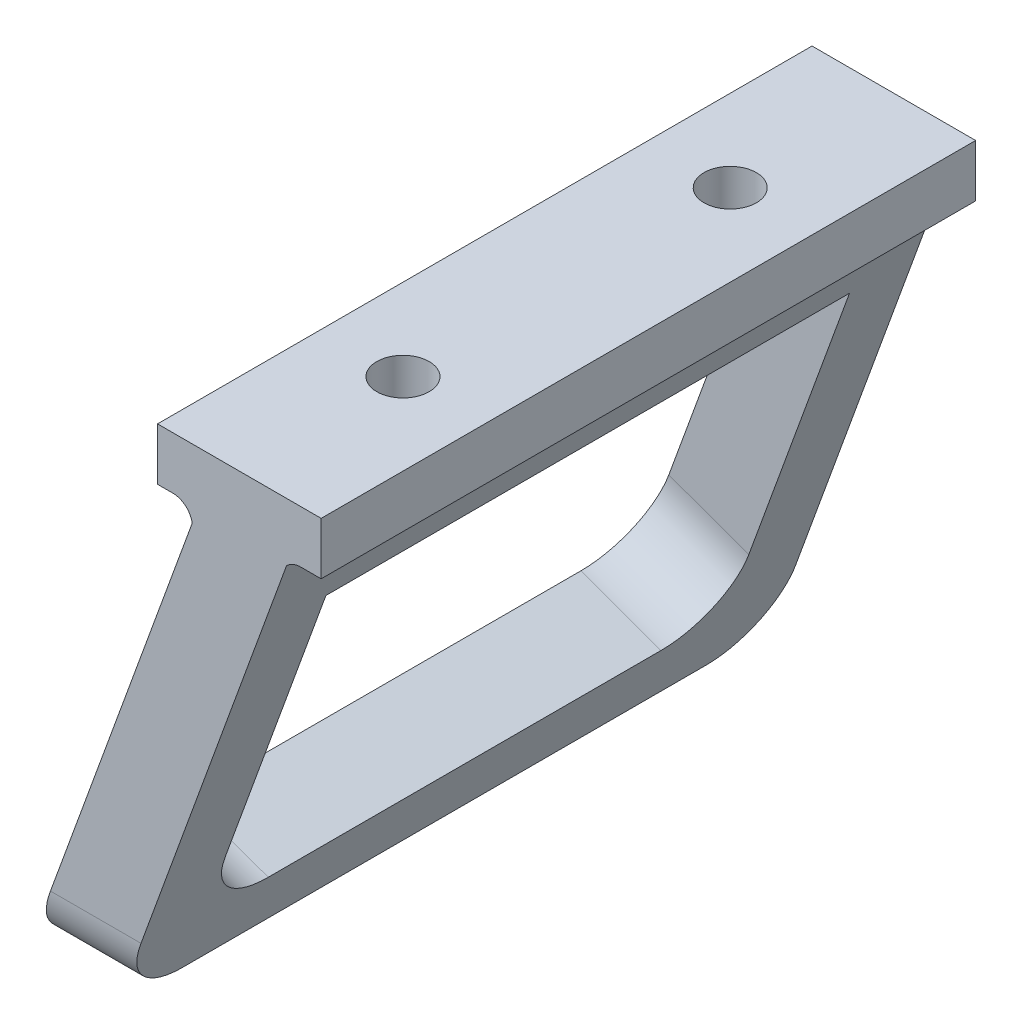
ISO-10303-21;
HEADER;
FILE_DESCRIPTION(('STEP AP214'),'2;1');
FILE_NAME('part.step','',(''),(''),'','','');
FILE_SCHEMA(('AUTOMOTIVE_DESIGN { 1 0 10303 214 1 1 1 1 }'));
ENDSEC;
DATA;
#1=APPLICATION_CONTEXT('core data for automotive mechanical design processes');
#2=APPLICATION_PROTOCOL_DEFINITION('international standard','automotive_design',2000,#1);
#3=PRODUCT_CONTEXT('',#1,'mechanical');
#4=PRODUCT('Part','Part','',(#3));
#5=PRODUCT_RELATED_PRODUCT_CATEGORY('part','',(#4));
#6=PRODUCT_DEFINITION_FORMATION('','',#4);
#7=PRODUCT_DEFINITION_CONTEXT('part definition',#1,'design');
#8=PRODUCT_DEFINITION('design','',#6,#7);
#9=PRODUCT_DEFINITION_SHAPE('','',#8);
#10=(LENGTH_UNIT() NAMED_UNIT(*) SI_UNIT(.MILLI.,.METRE.));
#11=(NAMED_UNIT(*) PLANE_ANGLE_UNIT() SI_UNIT($,.RADIAN.));
#12=(NAMED_UNIT(*) SI_UNIT($,.STERADIAN.) SOLID_ANGLE_UNIT());
#13=UNCERTAINTY_MEASURE_WITH_UNIT(LENGTH_MEASURE(1.E-05),#10,'distance_accuracy_value','');
#14=(GEOMETRIC_REPRESENTATION_CONTEXT(3) GLOBAL_UNCERTAINTY_ASSIGNED_CONTEXT((#13)) GLOBAL_UNIT_ASSIGNED_CONTEXT((#10,
#11,#12)) REPRESENTATION_CONTEXT('',''));
#15=CARTESIAN_POINT('',(0.,0.,0.));
#16=DIRECTION('',(0.,0.,1.));
#17=DIRECTION('',(1.,0.,0.));
#18=AXIS2_PLACEMENT_3D('',#15,#16,#17);
#19=CARTESIAN_POINT('',(-12.5,0.,-50.));
#20=DIRECTION('',(-1.,0.,0.));
#21=DIRECTION('',(0.,0.,1.));
#22=AXIS2_PLACEMENT_3D('',#19,#20,#21);
#23=PLANE('',#22);
#24=DIRECTION('',(0.,0.,1.));
#25=VECTOR('',#24,1.);
#26=CARTESIAN_POINT('',(-12.5,0.,-50.));
#27=LINE('',#26,#25);
#28=CARTESIAN_POINT('',(-12.5,0.,-50.));
#29=VERTEX_POINT('',#28);
#30=CARTESIAN_POINT('',(-12.5,0.,50.));
#31=VERTEX_POINT('',#30);
#32=EDGE_CURVE('E327',#29,#31,#27,.T.);
#33=ORIENTED_EDGE('',*,*,#32,.T.);
#34=DIRECTION('',(0.,-1.,0.));
#35=VECTOR('',#34,1.);
#36=CARTESIAN_POINT('',(-12.5,0.,50.));
#37=LINE('',#36,#35);
#38=CARTESIAN_POINT('',(-12.5,8.,50.));
#39=VERTEX_POINT('',#38);
#40=EDGE_CURVE('E257',#39,#31,#37,.T.);
#41=ORIENTED_EDGE('',*,*,#40,.F.);
#42=DIRECTION('',(0.,0.,1.));
#43=VECTOR('',#42,1.);
#44=CARTESIAN_POINT('',(-12.5,8.,-50.));
#45=LINE('',#44,#43);
#46=CARTESIAN_POINT('',(-12.5,8.,-50.));
#47=VERTEX_POINT('',#46);
#48=EDGE_CURVE('E328',#47,#39,#45,.T.);
#49=ORIENTED_EDGE('',*,*,#48,.F.);
#50=DIRECTION('',(0.,-1.,0.));
#51=VECTOR('',#50,1.);
#52=CARTESIAN_POINT('',(-12.5,0.,-50.));
#53=LINE('',#52,#51);
#54=EDGE_CURVE('E292',#47,#29,#53,.T.);
#55=ORIENTED_EDGE('',*,*,#54,.T.);
#56=EDGE_LOOP('',(#33,#41,#49,#55));
#57=FACE_BOUND('',#56,.T.);
#58=ADVANCED_FACE('F43',(#57),#23,.T.);
#59=CARTESIAN_POINT('',(-12.5,8.,-50.));
#60=DIRECTION('',(0.,1.,0.));
#61=DIRECTION('',(0.,0.,1.));
#62=AXIS2_PLACEMENT_3D('',#59,#60,#61);
#63=PLANE('',#62);
#64=CARTESIAN_POINT('',(0.,8.,-25.));
#65=DIRECTION('',(0.,1.,0.));
#66=DIRECTION('',(0.,0.,1.));
#67=AXIS2_PLACEMENT_3D('',#64,#65,#66);
#68=CIRCLE('',#67,3.99999999999999);
#69=CARTESIAN_POINT('',(0.,8.,-21.));
#70=VERTEX_POINT('',#69);
#71=EDGE_CURVE('E186',#70,#70,#68,.T.);
#72=ORIENTED_EDGE('',*,*,#71,.F.);
#73=EDGE_LOOP('',(#72));
#74=FACE_BOUND('',#73,.T.);
#75=CARTESIAN_POINT('',(0.,8.,25.));
#76=DIRECTION('',(0.,1.,0.));
#77=DIRECTION('',(0.,0.,1.));
#78=AXIS2_PLACEMENT_3D('',#75,#76,#77);
#79=CIRCLE('',#78,3.99999999999999);
#80=CARTESIAN_POINT('',(0.,8.,29.));
#81=VERTEX_POINT('',#80);
#82=EDGE_CURVE('E185',#81,#81,#79,.T.);
#83=ORIENTED_EDGE('',*,*,#82,.F.);
#84=EDGE_LOOP('',(#83));
#85=FACE_BOUND('',#84,.T.);
#86=ORIENTED_EDGE('',*,*,#48,.T.);
#87=DIRECTION('',(-1.,0.,0.));
#88=VECTOR('',#87,1.);
#89=CARTESIAN_POINT('',(-12.5,8.,50.));
#90=LINE('',#89,#88);
#91=CARTESIAN_POINT('',(12.5,8.,50.));
#92=VERTEX_POINT('',#91);
#93=EDGE_CURVE('E288',#92,#39,#90,.T.);
#94=ORIENTED_EDGE('',*,*,#93,.F.);
#95=DIRECTION('',(0.,0.,1.));
#96=VECTOR('',#95,1.);
#97=CARTESIAN_POINT('',(12.5,8.,-50.));
#98=LINE('',#97,#96);
#99=CARTESIAN_POINT('',(12.5,8.,-50.));
#100=VERTEX_POINT('',#99);
#101=EDGE_CURVE('E332',#100,#92,#98,.T.);
#102=ORIENTED_EDGE('',*,*,#101,.F.);
#103=DIRECTION('',(-1.,0.,0.));
#104=VECTOR('',#103,1.);
#105=CARTESIAN_POINT('',(-12.5,8.,-50.));
#106=LINE('',#105,#104);
#107=EDGE_CURVE('E323',#100,#47,#106,.T.);
#108=ORIENTED_EDGE('',*,*,#107,.T.);
#109=EDGE_LOOP('',(#86,#94,#102,#108));
#110=FACE_BOUND('',#109,.T.);
#111=ADVANCED_FACE('F426',(#74,#85,#110),#63,.T.);
#112=CARTESIAN_POINT('',(12.5,8.,-50.));
#113=DIRECTION('',(1.,0.,0.));
#114=DIRECTION('',(0.,1.,0.));
#115=AXIS2_PLACEMENT_3D('',#112,#113,#114);
#116=PLANE('',#115);
#117=ORIENTED_EDGE('',*,*,#101,.T.);
#118=DIRECTION('',(0.,1.,0.));
#119=VECTOR('',#118,1.);
#120=CARTESIAN_POINT('',(12.5,8.,50.));
#121=LINE('',#120,#119);
#122=CARTESIAN_POINT('',(12.5,0.,50.));
#123=VERTEX_POINT('',#122);
#124=EDGE_CURVE('E284',#123,#92,#121,.T.);
#125=ORIENTED_EDGE('',*,*,#124,.F.);
#126=DIRECTION('',(0.,0.,1.));
#127=VECTOR('',#126,1.);
#128=CARTESIAN_POINT('',(12.5,0.,-50.));
#129=LINE('',#128,#127);
#130=CARTESIAN_POINT('',(12.5,0.,-50.));
#131=VERTEX_POINT('',#130);
#132=EDGE_CURVE('E335',#131,#123,#129,.T.);
#133=ORIENTED_EDGE('',*,*,#132,.F.);
#134=DIRECTION('',(0.,1.,0.));
#135=VECTOR('',#134,1.);
#136=CARTESIAN_POINT('',(12.5,8.,-50.));
#137=LINE('',#136,#135);
#138=EDGE_CURVE('E319',#131,#100,#137,.T.);
#139=ORIENTED_EDGE('',*,*,#138,.T.);
#140=EDGE_LOOP('',(#117,#125,#133,#139));
#141=FACE_BOUND('',#140,.T.);
#142=ADVANCED_FACE('F429',(#141),#116,.T.);
#143=CARTESIAN_POINT('',(12.5,0.,-50.));
#144=DIRECTION('',(0.,-1.,0.));
#145=DIRECTION('',(1.,0.,0.));
#146=AXIS2_PLACEMENT_3D('',#143,#144,#145);
#147=PLANE('',#146);
#148=ORIENTED_EDGE('',*,*,#132,.T.);
#149=DIRECTION('',(1.,0.,0.));
#150=VECTOR('',#149,1.);
#151=CARTESIAN_POINT('',(12.5,0.,50.));
#152=LINE('',#151,#150);
#153=CARTESIAN_POINT('',(9.37580741713609,0.,50.));
#154=VERTEX_POINT('',#153);
#155=EDGE_CURVE('E280',#154,#123,#152,.T.);
#156=ORIENTED_EDGE('',*,*,#155,.F.);
#157=DIRECTION('',(0.,0.,1.));
#158=VECTOR('',#157,1.);
#159=CARTESIAN_POINT('',(9.37580741713609,0.,-50.));
#160=LINE('',#159,#158);
#161=CARTESIAN_POINT('',(9.37580741713609,0.,-50.));
#162=VERTEX_POINT('',#161);
#163=EDGE_CURVE('E338',#162,#154,#160,.T.);
#164=ORIENTED_EDGE('',*,*,#163,.F.);
#165=DIRECTION('',(1.,0.,0.));
#166=VECTOR('',#165,1.);
#167=CARTESIAN_POINT('',(12.5,0.,-50.));
#168=LINE('',#167,#166);
#169=EDGE_CURVE('E315',#162,#131,#168,.T.);
#170=ORIENTED_EDGE('',*,*,#169,.T.);
#171=EDGE_LOOP('',(#148,#156,#164,#170));
#172=FACE_BOUND('',#171,.T.);
#173=ADVANCED_FACE('F431',(#172),#147,.T.);
#174=CARTESIAN_POINT('',(9.37580741713609,-3.,-50.));
#175=DIRECTION('',(0.,0.,1.));
#176=DIRECTION('',(1.,0.,0.));
#177=AXIS2_PLACEMENT_3D('',#174,#175,#176);
#178=CYLINDRICAL_SURFACE('',#177,2.99999999999998);
#179=ORIENTED_EDGE('',*,*,#163,.T.);
#180=CARTESIAN_POINT('',(9.37580741713609,-3.,50.));
#181=DIRECTION('',(0.,0.,-1.));
#182=DIRECTION('',(1.,0.,0.));
#183=AXIS2_PLACEMENT_3D('',#180,#181,#182);
#184=CIRCLE('',#183,2.99999999999998);
#185=CARTESIAN_POINT('',(7.20000000000002,-0.934603649771899,50.));
#186=VERTEX_POINT('',#185);
#187=EDGE_CURVE('E276',#186,#154,#184,.T.);
#188=ORIENTED_EDGE('',*,*,#187,.F.);
#189=DIRECTION('',(0.,0.,1.));
#190=VECTOR('',#189,1.);
#191=CARTESIAN_POINT('',(7.20000000000002,-0.934603649771899,-50.));
#192=LINE('',#191,#190);
#193=CARTESIAN_POINT('',(7.20000000000002,-0.934603649771899,-50.));
#194=VERTEX_POINT('',#193);
#195=EDGE_CURVE('E341',#194,#186,#192,.T.);
#196=ORIENTED_EDGE('',*,*,#195,.F.);
#197=CARTESIAN_POINT('',(9.37580741713609,-3.,-50.));
#198=DIRECTION('',(0.,0.,-1.));
#199=DIRECTION('',(1.,0.,0.));
#200=AXIS2_PLACEMENT_3D('',#197,#198,#199);
#201=CIRCLE('',#200,2.99999999999998);
#202=EDGE_CURVE('E311',#194,#162,#201,.T.);
#203=ORIENTED_EDGE('',*,*,#202,.T.);
#204=EDGE_LOOP('',(#179,#188,#196,#203));
#205=FACE_BOUND('',#204,.T.);
#206=ADVANCED_FACE('F403',(#205),#178,.F.);
#207=CARTESIAN_POINT('',(7.20000000000003,-0.934603649771912,-50.));
#208=DIRECTION('',(0.939692620785908,-0.34202014332567,0.));
#209=DIRECTION('',(0.34202014332567,0.939692620785908,0.));
#210=AXIS2_PLACEMENT_3D('',#207,#208,#209);
#211=PLANE('',#210);
#212=DIRECTION('',(0.34202014332567,0.939692620785908,0.));
#213=VECTOR('',#212,1.);
#214=CARTESIAN_POINT('',(7.20000000000003,-0.934603649771911,-40.));
#215=LINE('',#214,#213);
#216=CARTESIAN_POINT('',(-12.1631879404359,-54.1345252847756,-40.));
#217=VERTEX_POINT('',#216);
#218=CARTESIAN_POINT('',(3.22771850921919,-11.8483573494098,-40.));
#219=VERTEX_POINT('',#218);
#220=EDGE_CURVE('E254',#217,#219,#215,.T.);
#221=ORIENTED_EDGE('',*,*,#220,.F.);
#222=CARTESIAN_POINT('',(-12.163187940436,-54.1345252847757,-30.));
#223=DIRECTION('',(0.939692620785908,-0.34202014332567,0.));
#224=DIRECTION('',(0.34202014332567,0.939692620785908,0.));
#225=AXIS2_PLACEMENT_3D('',#222,#223,#224);
#226=CIRCLE('',#225,10.);
#227=CARTESIAN_POINT('',(-15.5833893736927,-63.5314514926347,-29.9999999999999));
#228=VERTEX_POINT('',#227);
#229=EDGE_CURVE('E224',#228,#217,#226,.T.);
#230=ORIENTED_EDGE('',*,*,#229,.F.);
#231=DIRECTION('',(0.,0.,-1.));
#232=VECTOR('',#231,1.);
#233=CARTESIAN_POINT('',(-15.5833893736927,-63.5314514926347,-50.));
#234=LINE('',#233,#232);
#235=CARTESIAN_POINT('',(-15.5833893736927,-63.5314514926347,29.9999999999999));
#236=VERTEX_POINT('',#235);
#237=EDGE_CURVE('E240',#236,#228,#234,.T.);
#238=ORIENTED_EDGE('',*,*,#237,.F.);
#239=CARTESIAN_POINT('',(-12.163187940436,-54.1345252847757,30.));
#240=DIRECTION('',(0.939692620785908,-0.34202014332567,0.));
#241=DIRECTION('',(0.34202014332567,0.939692620785908,0.));
#242=AXIS2_PLACEMENT_3D('',#239,#240,#241);
#243=CIRCLE('',#242,10.);
#244=CARTESIAN_POINT('',(-12.1631879404359,-54.1345252847756,40.));
#245=VERTEX_POINT('',#244);
#246=EDGE_CURVE('E243',#245,#236,#243,.T.);
#247=ORIENTED_EDGE('',*,*,#246,.F.);
#248=DIRECTION('',(0.34202014332567,0.939692620785908,0.));
#249=VECTOR('',#248,1.);
#250=CARTESIAN_POINT('',(7.20000000000003,-0.934603649771925,40.));
#251=LINE('',#250,#249);
#252=CARTESIAN_POINT('',(3.22771850921919,-11.8483573494098,40.));
#253=VERTEX_POINT('',#252);
#254=EDGE_CURVE('E246',#245,#253,#251,.T.);
#255=ORIENTED_EDGE('',*,*,#254,.T.);
#256=DIRECTION('',(0.,0.,-1.));
#257=VECTOR('',#256,1.);
#258=CARTESIAN_POINT('',(3.22771850921919,-11.8483573494098,-50.));
#259=LINE('',#258,#257);
#260=EDGE_CURVE('E250',#253,#219,#259,.T.);
#261=ORIENTED_EDGE('',*,*,#260,.T.);
#262=EDGE_LOOP('',(#221,#230,#238,#247,#255,#261));
#263=FACE_BOUND('',#262,.T.);
#264=DIRECTION('',(0.,0.,1.));
#265=VECTOR('',#264,1.);
#266=CARTESIAN_POINT('',(-18.6656889578131,-72.,-50.));
#267=LINE('',#266,#265);
#268=CARTESIAN_POINT('',(-18.6656889578131,-72.,-40.));
#269=VERTEX_POINT('',#268);
#270=CARTESIAN_POINT('',(-18.6656889578131,-72.,40.));
#271=VERTEX_POINT('',#270);
#272=EDGE_CURVE('E345',#269,#271,#267,.T.);
#273=ORIENTED_EDGE('',*,*,#272,.F.);
#274=CARTESIAN_POINT('',(-15.0259866151511,-62.,-40.));
#275=DIRECTION('',(0.939692620785908,-0.34202014332567,0.));
#276=DIRECTION('',(-0.34202014332567,-0.939692620785908,0.));
#277=AXIS2_PLACEMENT_3D('',#274,#275,#276);
#278=ELLIPSE('',#277,10.6417777247591,10.);
#279=CARTESIAN_POINT('',(-15.0259866151511,-62.,-50.));
#280=VERTEX_POINT('',#279);
#281=EDGE_CURVE('E370',#269,#280,#278,.T.);
#282=ORIENTED_EDGE('',*,*,#281,.T.);
#283=DIRECTION('',(0.34202014332567,0.939692620785908,0.));
#284=VECTOR('',#283,1.);
#285=CARTESIAN_POINT('',(7.20000000000003,-0.934603649771912,-50.));
#286=LINE('',#285,#284);
#287=EDGE_CURVE('E308',#280,#194,#286,.T.);
#288=ORIENTED_EDGE('',*,*,#287,.T.);
#289=ORIENTED_EDGE('',*,*,#195,.T.);
#290=DIRECTION('',(0.34202014332567,0.939692620785908,0.));
#291=VECTOR('',#290,1.);
#292=CARTESIAN_POINT('',(7.20000000000003,-0.934603649771912,50.));
#293=LINE('',#292,#291);
#294=CARTESIAN_POINT('',(-15.0259866151511,-62.,50.));
#295=VERTEX_POINT('',#294);
#296=EDGE_CURVE('E273',#295,#186,#293,.T.);
#297=ORIENTED_EDGE('',*,*,#296,.F.);
#298=CARTESIAN_POINT('',(-15.0259866151511,-62.,40.));
#299=DIRECTION('',(0.939692620785908,-0.34202014332567,0.));
#300=DIRECTION('',(0.34202014332567,0.939692620785908,0.));
#301=AXIS2_PLACEMENT_3D('',#298,#299,#300);
#302=ELLIPSE('',#301,10.6417777247591,10.);
#303=EDGE_CURVE('E367',#295,#271,#302,.T.);
#304=ORIENTED_EDGE('',*,*,#303,.T.);
#305=EDGE_LOOP('',(#273,#282,#288,#289,#297,#304));
#306=FACE_BOUND('',#305,.T.);
#307=ADVANCED_FACE('F395',(#263,#306),#211,.T.);
#308=CARTESIAN_POINT('',(-18.6656889578131,-72.,-50.));
#309=DIRECTION('',(0.,-1.,0.));
#310=DIRECTION('',(1.,0.,0.));
#311=AXIS2_PLACEMENT_3D('',#308,#309,#310);
#312=PLANE('',#311);
#313=DIRECTION('',(0.,0.,1.));
#314=VECTOR('',#313,1.);
#315=CARTESIAN_POINT('',(-32.5,-72.,-50.));
#316=LINE('',#315,#314);
#317=CARTESIAN_POINT('',(-32.5,-72.,-40.));
#318=VERTEX_POINT('',#317);
#319=CARTESIAN_POINT('',(-32.5,-72.,40.));
#320=VERTEX_POINT('',#319);
#321=EDGE_CURVE('E349',#318,#320,#316,.T.);
#322=ORIENTED_EDGE('',*,*,#321,.F.);
#323=DIRECTION('',(1.,0.,0.));
#324=VECTOR('',#323,1.);
#325=CARTESIAN_POINT('',(-18.6656889578131,-72.,-40.));
#326=LINE('',#325,#324);
#327=EDGE_CURVE('E363',#318,#269,#326,.T.);
#328=ORIENTED_EDGE('',*,*,#327,.T.);
#329=ORIENTED_EDGE('',*,*,#272,.T.);
#330=DIRECTION('',(1.,0.,0.));
#331=VECTOR('',#330,1.);
#332=CARTESIAN_POINT('',(-18.6656889578131,-72.,40.));
#333=LINE('',#332,#331);
#334=EDGE_CURVE('E331',#271,#320,#333,.F.);
#335=ORIENTED_EDGE('',*,*,#334,.T.);
#336=EDGE_LOOP('',(#322,#328,#329,#335));
#337=FACE_BOUND('',#336,.T.);
#338=ADVANCED_FACE('F389',(#337),#312,.T.);
#339=CARTESIAN_POINT('',(-32.5,-72.,-50.));
#340=DIRECTION('',(-0.939692620785908,0.34202014332567,0.));
#341=DIRECTION('',(-0.34202014332567,-0.939692620785908,0.));
#342=AXIS2_PLACEMENT_3D('',#339,#340,#341);
#343=PLANE('',#342);
#344=DIRECTION('',(-0.34202014332567,-0.939692620785908,0.));
#345=VECTOR('',#344,1.);
#346=CARTESIAN_POINT('',(-8.98828556099762,-7.40209548617608,-40.));
#347=LINE('',#346,#345);
#348=CARTESIAN_POINT('',(-8.98828556099762,-7.40209548617608,-40.));
#349=VERTEX_POINT('',#348);
#350=CARTESIAN_POINT('',(-24.3791920106527,-49.6882634215419,-40.));
#351=VERTEX_POINT('',#350);
#352=EDGE_CURVE('E67',#349,#351,#347,.T.);
#353=ORIENTED_EDGE('',*,*,#352,.F.);
#354=DIRECTION('',(0.,0.,1.));
#355=VECTOR('',#354,1.);
#356=CARTESIAN_POINT('',(-8.98828556099762,-7.40209548617608,-40.));
#357=LINE('',#356,#355);
#358=CARTESIAN_POINT('',(-8.98828556099762,-7.40209548617608,40.));
#359=VERTEX_POINT('',#358);
#360=EDGE_CURVE('E216',#349,#359,#357,.T.);
#361=ORIENTED_EDGE('',*,*,#360,.T.);
#362=DIRECTION('',(-0.34202014332567,-0.939692620785908,0.));
#363=VECTOR('',#362,1.);
#364=CARTESIAN_POINT('',(-8.98828556099762,-7.40209548617608,40.));
#365=LINE('',#364,#363);
#366=CARTESIAN_POINT('',(-24.3791920106527,-49.6882634215419,40.));
#367=VERTEX_POINT('',#366);
#368=EDGE_CURVE('E212',#359,#367,#365,.T.);
#369=ORIENTED_EDGE('',*,*,#368,.T.);
#370=CARTESIAN_POINT('',(-24.3791920106528,-49.6882634215419,30.));
#371=DIRECTION('',(-0.939692620785908,0.34202014332567,0.));
#372=DIRECTION('',(-0.34202014332567,-0.939692620785908,0.));
#373=AXIS2_PLACEMENT_3D('',#370,#371,#372);
#374=CIRCLE('',#373,10.);
#375=CARTESIAN_POINT('',(-27.7993934439095,-59.085189629401,29.9999999999999));
#376=VERTEX_POINT('',#375);
#377=EDGE_CURVE('E208',#376,#367,#374,.T.);
#378=ORIENTED_EDGE('',*,*,#377,.F.);
#379=DIRECTION('',(0.,0.,1.));
#380=VECTOR('',#379,1.);
#381=CARTESIAN_POINT('',(-27.7993934439095,-59.085189629401,-29.9999999999999));
#382=LINE('',#381,#380);
#383=CARTESIAN_POINT('',(-27.7993934439095,-59.085189629401,-29.9999999999999));
#384=VERTEX_POINT('',#383);
#385=EDGE_CURVE('E204',#384,#376,#382,.T.);
#386=ORIENTED_EDGE('',*,*,#385,.F.);
#387=CARTESIAN_POINT('',(-24.3791920106528,-49.6882634215419,-30.));
#388=DIRECTION('',(-0.939692620785908,0.34202014332567,0.));
#389=DIRECTION('',(-0.34202014332567,-0.939692620785908,0.));
#390=AXIS2_PLACEMENT_3D('',#387,#388,#389);
#391=CIRCLE('',#390,10.);
#392=EDGE_CURVE('E201',#351,#384,#391,.T.);
#393=ORIENTED_EDGE('',*,*,#392,.F.);
#394=EDGE_LOOP('',(#353,#361,#369,#378,#386,#393));
#395=FACE_BOUND('',#394,.T.);
#396=DIRECTION('',(-0.34202014332567,-0.939692620785908,0.));
#397=VECTOR('',#396,1.);
#398=CARTESIAN_POINT('',(-32.5,-72.,-50.));
#399=LINE('',#398,#397);
#400=CARTESIAN_POINT('',(-7.19999999999997,-2.48882128779831,-50.));
#401=VERTEX_POINT('',#400);
#402=CARTESIAN_POINT('',(-28.8602976573379,-62.,-50.));
#403=VERTEX_POINT('',#402);
#404=EDGE_CURVE('E304',#401,#403,#399,.T.);
#405=ORIENTED_EDGE('',*,*,#404,.T.);
#406=CARTESIAN_POINT('',(-28.8602976573379,-62.,-40.));
#407=DIRECTION('',(-0.939692620785908,0.34202014332567,0.));
#408=DIRECTION('',(-0.34202014332567,-0.939692620785908,0.));
#409=AXIS2_PLACEMENT_3D('',#406,#407,#408);
#410=ELLIPSE('',#409,10.6417777247591,10.);
#411=EDGE_CURVE('E52',#403,#318,#410,.T.);
#412=ORIENTED_EDGE('',*,*,#411,.T.);
#413=ORIENTED_EDGE('',*,*,#321,.T.);
#414=CARTESIAN_POINT('',(-28.8602976573379,-62.,40.));
#415=DIRECTION('',(-0.939692620785908,0.34202014332567,0.));
#416=DIRECTION('',(0.34202014332567,0.939692620785908,0.));
#417=AXIS2_PLACEMENT_3D('',#414,#415,#416);
#418=ELLIPSE('',#417,10.6417777247591,10.);
#419=CARTESIAN_POINT('',(-28.8602976573379,-62.,50.));
#420=VERTEX_POINT('',#419);
#421=EDGE_CURVE('E376',#320,#420,#418,.T.);
#422=ORIENTED_EDGE('',*,*,#421,.T.);
#423=DIRECTION('',(-0.34202014332567,-0.939692620785908,0.));
#424=VECTOR('',#423,1.);
#425=CARTESIAN_POINT('',(-32.5,-72.,50.));
#426=LINE('',#425,#424);
#427=CARTESIAN_POINT('',(-7.19999999999997,-2.48882128779831,50.));
#428=VERTEX_POINT('',#427);
#429=EDGE_CURVE('E269',#428,#420,#426,.T.);
#430=ORIENTED_EDGE('',*,*,#429,.F.);
#431=DIRECTION('',(0.,0.,1.));
#432=VECTOR('',#431,1.);
#433=CARTESIAN_POINT('',(-7.19999999999997,-2.48882128779831,-50.));
#434=LINE('',#433,#432);
#435=EDGE_CURVE('E353',#401,#428,#434,.T.);
#436=ORIENTED_EDGE('',*,*,#435,.F.);
#437=EDGE_LOOP('',(#405,#412,#413,#422,#430,#436));
#438=FACE_BOUND('',#437,.T.);
#439=ADVANCED_FACE('F382',(#395,#438),#343,.T.);
#440=CARTESIAN_POINT('',(-10.1561286041361,-3.,-50.));
#441=DIRECTION('',(0.,0.,1.));
#442=DIRECTION('',(1.,0.,0.));
#443=AXIS2_PLACEMENT_3D('',#440,#441,#442);
#444=CYLINDRICAL_SURFACE('',#443,3.);
#445=ORIENTED_EDGE('',*,*,#435,.T.);
#446=CARTESIAN_POINT('',(-10.1561286041361,-3.,50.));
#447=DIRECTION('',(0.,0.,-1.));
#448=DIRECTION('',(1.,0.,0.));
#449=AXIS2_PLACEMENT_3D('',#446,#447,#448);
#450=CIRCLE('',#449,3.);
#451=CARTESIAN_POINT('',(-10.1561286041361,0.,50.));
#452=VERTEX_POINT('',#451);
#453=EDGE_CURVE('E265',#452,#428,#450,.T.);
#454=ORIENTED_EDGE('',*,*,#453,.F.);
#455=DIRECTION('',(0.,0.,1.));
#456=VECTOR('',#455,1.);
#457=CARTESIAN_POINT('',(-10.1561286041361,0.,-50.));
#458=LINE('',#457,#456);
#459=CARTESIAN_POINT('',(-10.1561286041361,0.,-50.));
#460=VERTEX_POINT('',#459);
#461=EDGE_CURVE('E356',#460,#452,#458,.T.);
#462=ORIENTED_EDGE('',*,*,#461,.F.);
#463=CARTESIAN_POINT('',(-10.1561286041361,-3.,-50.));
#464=DIRECTION('',(0.,0.,-1.));
#465=DIRECTION('',(1.,0.,0.));
#466=AXIS2_PLACEMENT_3D('',#463,#464,#465);
#467=CIRCLE('',#466,3.);
#468=EDGE_CURVE('E300',#460,#401,#467,.T.);
#469=ORIENTED_EDGE('',*,*,#468,.T.);
#470=EDGE_LOOP('',(#445,#454,#462,#469));
#471=FACE_BOUND('',#470,.T.);
#472=ADVANCED_FACE('F416',(#471),#444,.F.);
#473=CARTESIAN_POINT('',(-10.1561286041361,0.,-50.));
#474=DIRECTION('',(0.,-1.,0.));
#475=DIRECTION('',(0.,0.,-1.));
#476=AXIS2_PLACEMENT_3D('',#473,#474,#475);
#477=PLANE('',#476);
#478=ORIENTED_EDGE('',*,*,#461,.T.);
#479=DIRECTION('',(1.,0.,0.));
#480=VECTOR('',#479,1.);
#481=CARTESIAN_POINT('',(-10.1561286041361,0.,50.));
#482=LINE('',#481,#480);
#483=EDGE_CURVE('E261',#31,#452,#482,.T.);
#484=ORIENTED_EDGE('',*,*,#483,.F.);
#485=ORIENTED_EDGE('',*,*,#32,.F.);
#486=DIRECTION('',(1.,0.,0.));
#487=VECTOR('',#486,1.);
#488=CARTESIAN_POINT('',(-10.1561286041361,0.,-50.));
#489=LINE('',#488,#487);
#490=EDGE_CURVE('E296',#29,#460,#489,.T.);
#491=ORIENTED_EDGE('',*,*,#490,.T.);
#492=EDGE_LOOP('',(#478,#484,#485,#491));
#493=FACE_BOUND('',#492,.T.);
#494=ADVANCED_FACE('F419',(#493),#477,.T.);
#495=CARTESIAN_POINT('',(9.37580741713609,-3.,-50.));
#496=DIRECTION('',(0.,0.,1.));
#497=DIRECTION('',(1.,0.,0.));
#498=AXIS2_PLACEMENT_3D('',#495,#496,#497);
#499=PLANE('',#498);
#500=ORIENTED_EDGE('',*,*,#287,.F.);
#501=DIRECTION('',(1.,0.,0.));
#502=VECTOR('',#501,1.);
#503=CARTESIAN_POINT('',(-32.4999999999999,-62.,-50.));
#504=LINE('',#503,#502);
#505=EDGE_CURVE('E373',#280,#403,#504,.F.);
#506=ORIENTED_EDGE('',*,*,#505,.T.);
#507=ORIENTED_EDGE('',*,*,#404,.F.);
#508=ORIENTED_EDGE('',*,*,#468,.F.);
#509=ORIENTED_EDGE('',*,*,#490,.F.);
#510=ORIENTED_EDGE('',*,*,#54,.F.);
#511=ORIENTED_EDGE('',*,*,#107,.F.);
#512=ORIENTED_EDGE('',*,*,#138,.F.);
#513=ORIENTED_EDGE('',*,*,#169,.F.);
#514=ORIENTED_EDGE('',*,*,#202,.F.);
#515=EDGE_LOOP('',(#500,#506,#507,#508,#509,#510,#511,#512,#513,#514));
#516=FACE_BOUND('',#515,.T.);
#517=ADVANCED_FACE('F399',(#516),#499,.F.);
#518=CARTESIAN_POINT('',(9.37580741713609,-3.,50.));
#519=DIRECTION('',(0.,0.,1.));
#520=DIRECTION('',(1.,0.,0.));
#521=AXIS2_PLACEMENT_3D('',#518,#519,#520);
#522=PLANE('',#521);
#523=ORIENTED_EDGE('',*,*,#429,.T.);
#524=DIRECTION('',(1.,0.,0.));
#525=VECTOR('',#524,1.);
#526=CARTESIAN_POINT('',(9.37580741713603,-62.,50.));
#527=LINE('',#526,#525);
#528=EDGE_CURVE('E11',#420,#295,#527,.T.);
#529=ORIENTED_EDGE('',*,*,#528,.T.);
#530=ORIENTED_EDGE('',*,*,#296,.T.);
#531=ORIENTED_EDGE('',*,*,#187,.T.);
#532=ORIENTED_EDGE('',*,*,#155,.T.);
#533=ORIENTED_EDGE('',*,*,#124,.T.);
#534=ORIENTED_EDGE('',*,*,#93,.T.);
#535=ORIENTED_EDGE('',*,*,#40,.T.);
#536=ORIENTED_EDGE('',*,*,#483,.T.);
#537=ORIENTED_EDGE('',*,*,#453,.T.);
#538=EDGE_LOOP('',(#523,#529,#530,#531,#532,#533,#534,#535,#536,#537));
#539=FACE_BOUND('',#538,.T.);
#540=ADVANCED_FACE('F407',(#539),#522,.T.);
#541=CARTESIAN_POINT('',(-18.6656889578131,-62.,-40.));
#542=DIRECTION('',(-1.,0.,0.));
#543=DIRECTION('',(0.,-1.,0.));
#544=AXIS2_PLACEMENT_3D('',#541,#542,#543);
#545=CYLINDRICAL_SURFACE('',#544,10.);
#546=ORIENTED_EDGE('',*,*,#411,.F.);
#547=ORIENTED_EDGE('',*,*,#505,.F.);
#548=ORIENTED_EDGE('',*,*,#281,.F.);
#549=ORIENTED_EDGE('',*,*,#327,.F.);
#550=EDGE_LOOP('',(#546,#547,#548,#549));
#551=FACE_BOUND('',#550,.T.);
#552=ADVANCED_FACE('F392',(#551),#545,.T.);
#553=CARTESIAN_POINT('',(9.37580741713603,-62.,40.));
#554=DIRECTION('',(1.,0.,0.));
#555=DIRECTION('',(0.,1.,0.));
#556=AXIS2_PLACEMENT_3D('',#553,#554,#555);
#557=CYLINDRICAL_SURFACE('',#556,10.);
#558=ORIENTED_EDGE('',*,*,#421,.F.);
#559=ORIENTED_EDGE('',*,*,#334,.F.);
#560=ORIENTED_EDGE('',*,*,#303,.F.);
#561=ORIENTED_EDGE('',*,*,#528,.F.);
#562=EDGE_LOOP('',(#558,#559,#560,#561));
#563=FACE_BOUND('',#562,.T.);
#564=ADVANCED_FACE('F45',(#563),#557,.T.);
#565=CARTESIAN_POINT('',(37.9963454782978,-24.5031026524596,-40.));
#566=DIRECTION('',(0.,0.,-1.));
#567=DIRECTION('',(0.,1.,0.));
#568=AXIS2_PLACEMENT_3D('',#565,#566,#567);
#569=PLANE('',#568);
#570=ORIENTED_EDGE('',*,*,#220,.T.);
#571=DIRECTION('',(-0.939692620785908,0.34202014332567,0.));
#572=VECTOR('',#571,1.);
#573=CARTESIAN_POINT('',(37.9963454782978,-24.5031026524596,-40.));
#574=LINE('',#573,#572);
#575=EDGE_CURVE('E221',#219,#349,#574,.T.);
#576=ORIENTED_EDGE('',*,*,#575,.T.);
#577=ORIENTED_EDGE('',*,*,#352,.T.);
#578=DIRECTION('',(-0.939692620785908,0.34202014332567,0.));
#579=VECTOR('',#578,1.);
#580=CARTESIAN_POINT('',(22.6054390286427,-66.7892705878254,-40.));
#581=LINE('',#580,#579);
#582=EDGE_CURVE('E220',#217,#351,#581,.T.);
#583=ORIENTED_EDGE('',*,*,#582,.F.);
#584=EDGE_LOOP('',(#570,#576,#577,#583));
#585=FACE_BOUND('',#584,.T.);
#586=ADVANCED_FACE('F454',(#585),#569,.F.);
#587=CARTESIAN_POINT('',(37.9963454782978,-24.5031026524596,-40.));
#588=DIRECTION('',(-0.34202014332567,-0.939692620785908,0.));
#589=DIRECTION('',(0.939692620785908,-0.34202014332567,0.));
#590=AXIS2_PLACEMENT_3D('',#587,#588,#589);
#591=PLANE('',#590);
#592=DIRECTION('',(-0.939692620785908,0.34202014332567,0.));
#593=VECTOR('',#592,1.);
#594=CARTESIAN_POINT('',(37.9963454782978,-24.5031026524596,40.));
#595=LINE('',#594,#593);
#596=EDGE_CURVE('E225',#253,#359,#595,.T.);
#597=ORIENTED_EDGE('',*,*,#596,.T.);
#598=ORIENTED_EDGE('',*,*,#360,.F.);
#599=ORIENTED_EDGE('',*,*,#575,.F.);
#600=ORIENTED_EDGE('',*,*,#260,.F.);
#601=EDGE_LOOP('',(#597,#598,#599,#600));
#602=FACE_BOUND('',#601,.T.);
#603=ADVANCED_FACE('F463',(#602),#591,.T.);
#604=CARTESIAN_POINT('',(37.9963454782978,-24.5031026524596,40.));
#605=DIRECTION('',(0.,0.,-1.));
#606=DIRECTION('',(0.,1.,0.));
#607=AXIS2_PLACEMENT_3D('',#604,#605,#606);
#608=PLANE('',#607);
#609=DIRECTION('',(-0.939692620785908,0.34202014332567,0.));
#610=VECTOR('',#609,1.);
#611=CARTESIAN_POINT('',(22.6054390286427,-66.7892705878254,40.));
#612=LINE('',#611,#610);
#613=EDGE_CURVE('E228',#245,#367,#612,.T.);
#614=ORIENTED_EDGE('',*,*,#613,.T.);
#615=ORIENTED_EDGE('',*,*,#368,.F.);
#616=ORIENTED_EDGE('',*,*,#596,.F.);
#617=ORIENTED_EDGE('',*,*,#254,.F.);
#618=EDGE_LOOP('',(#614,#615,#616,#617));
#619=FACE_BOUND('',#618,.T.);
#620=ADVANCED_FACE('F475',(#619),#608,.T.);
#621=CARTESIAN_POINT('',(22.6054390286426,-66.7892705878254,30.));
#622=DIRECTION('',(-0.939692620785908,0.34202014332567,0.));
#623=DIRECTION('',(-0.34202014332567,-0.939692620785908,0.));
#624=AXIS2_PLACEMENT_3D('',#621,#622,#623);
#625=CYLINDRICAL_SURFACE('',#624,10.);
#626=ORIENTED_EDGE('',*,*,#246,.T.);
#627=DIRECTION('',(-0.939692620785908,0.34202014332567,0.));
#628=VECTOR('',#627,1.);
#629=CARTESIAN_POINT('',(19.1852375953859,-76.1861967956845,29.9999999999999));
#630=LINE('',#629,#628);
#631=EDGE_CURVE('E231',#236,#376,#630,.T.);
#632=ORIENTED_EDGE('',*,*,#631,.T.);
#633=ORIENTED_EDGE('',*,*,#377,.T.);
#634=ORIENTED_EDGE('',*,*,#613,.F.);
#635=EDGE_LOOP('',(#626,#632,#633,#634));
#636=FACE_BOUND('',#635,.T.);
#637=ADVANCED_FACE('F471',(#636),#625,.F.);
#638=CARTESIAN_POINT('',(19.1852375953859,-76.1861967956845,-29.9999999999999));
#639=DIRECTION('',(-0.34202014332567,-0.939692620785908,0.));
#640=DIRECTION('',(0.939692620785908,-0.34202014332567,0.));
#641=AXIS2_PLACEMENT_3D('',#638,#639,#640);
#642=PLANE('',#641);
#643=ORIENTED_EDGE('',*,*,#237,.T.);
#644=DIRECTION('',(-0.939692620785908,0.34202014332567,0.));
#645=VECTOR('',#644,1.);
#646=CARTESIAN_POINT('',(19.1852375953859,-76.1861967956845,-29.9999999999999));
#647=LINE('',#646,#645);
#648=EDGE_CURVE('E59',#228,#384,#647,.T.);
#649=ORIENTED_EDGE('',*,*,#648,.T.);
#650=ORIENTED_EDGE('',*,*,#385,.T.);
#651=ORIENTED_EDGE('',*,*,#631,.F.);
#652=EDGE_LOOP('',(#643,#649,#650,#651));
#653=FACE_BOUND('',#652,.T.);
#654=ADVANCED_FACE('F468',(#653),#642,.F.);
#655=CARTESIAN_POINT('',(22.6054390286426,-66.7892705878254,-30.));
#656=DIRECTION('',(-0.939692620785908,0.34202014332567,0.));
#657=DIRECTION('',(-0.34202014332567,-0.939692620785908,0.));
#658=AXIS2_PLACEMENT_3D('',#655,#656,#657);
#659=CYLINDRICAL_SURFACE('',#658,10.);
#660=ORIENTED_EDGE('',*,*,#229,.T.);
#661=ORIENTED_EDGE('',*,*,#582,.T.);
#662=ORIENTED_EDGE('',*,*,#392,.T.);
#663=ORIENTED_EDGE('',*,*,#648,.F.);
#664=EDGE_LOOP('',(#660,#661,#662,#663));
#665=FACE_BOUND('',#664,.T.);
#666=ADVANCED_FACE('F464',(#665),#659,.F.);
#667=CARTESIAN_POINT('',(0.,-7.,25.));
#668=DIRECTION('',(0.,1.,0.));
#669=DIRECTION('',(0.,0.,1.));
#670=AXIS2_PLACEMENT_3D('',#667,#668,#669);
#671=CONICAL_SURFACE('',#670,3.99999999999999,1.02974425867665);
#672=CARTESIAN_POINT('',(0.,-9.40344247611024,25.));
#673=VERTEX_POINT('',#672);
#674=VERTEX_LOOP('',#673);
#675=FACE_BOUND('',#674,.T.);
#676=CARTESIAN_POINT('',(0.,-7.,25.));
#677=DIRECTION('',(0.,1.,0.));
#678=DIRECTION('',(0.,0.,1.));
#679=AXIS2_PLACEMENT_3D('',#676,#677,#678);
#680=CIRCLE('',#679,3.99999999999999);
#681=CARTESIAN_POINT('',(0.,-7.,29.));
#682=VERTEX_POINT('',#681);
#683=EDGE_CURVE('E191',#682,#682,#680,.T.);
#684=ORIENTED_EDGE('',*,*,#683,.T.);
#685=EDGE_LOOP('',(#684));
#686=FACE_BOUND('',#685,.T.);
#687=ADVANCED_FACE('F467',(#675,#686),#671,.F.);
#688=CARTESIAN_POINT('',(0.,8.,25.));
#689=DIRECTION('',(0.,1.,0.));
#690=DIRECTION('',(0.,0.,1.));
#691=AXIS2_PLACEMENT_3D('',#688,#689,#690);
#692=CYLINDRICAL_SURFACE('',#691,3.99999999999999);
#693=ORIENTED_EDGE('',*,*,#683,.F.);
#694=EDGE_LOOP('',(#693));
#695=FACE_BOUND('',#694,.T.);
#696=ORIENTED_EDGE('',*,*,#82,.T.);
#697=EDGE_LOOP('',(#696));
#698=FACE_BOUND('',#697,.T.);
#699=ADVANCED_FACE('F178',(#695,#698),#692,.F.);
#700=CARTESIAN_POINT('',(0.,-7.,-25.));
#701=DIRECTION('',(0.,1.,0.));
#702=DIRECTION('',(0.,0.,1.));
#703=AXIS2_PLACEMENT_3D('',#700,#701,#702);
#704=CONICAL_SURFACE('',#703,3.99999999999999,1.02974425867665);
#705=CARTESIAN_POINT('',(0.,-9.40344247611024,-25.));
#706=VERTEX_POINT('',#705);
#707=VERTEX_LOOP('',#706);
#708=FACE_BOUND('',#707,.T.);
#709=CARTESIAN_POINT('',(0.,-7.,-25.));
#710=DIRECTION('',(0.,1.,0.));
#711=DIRECTION('',(0.,0.,1.));
#712=AXIS2_PLACEMENT_3D('',#709,#710,#711);
#713=CIRCLE('',#712,3.99999999999999);
#714=CARTESIAN_POINT('',(0.,-7.,-21.));
#715=VERTEX_POINT('',#714);
#716=EDGE_CURVE('E182',#715,#715,#713,.T.);
#717=ORIENTED_EDGE('',*,*,#716,.T.);
#718=EDGE_LOOP('',(#717));
#719=FACE_BOUND('',#718,.T.);
#720=ADVANCED_FACE('F174',(#708,#719),#704,.F.);
#721=CARTESIAN_POINT('',(0.,8.,-25.));
#722=DIRECTION('',(0.,1.,0.));
#723=DIRECTION('',(0.,0.,1.));
#724=AXIS2_PLACEMENT_3D('',#721,#722,#723);
#725=CYLINDRICAL_SURFACE('',#724,3.99999999999999);
#726=ORIENTED_EDGE('',*,*,#716,.F.);
#727=EDGE_LOOP('',(#726));
#728=FACE_BOUND('',#727,.T.);
#729=ORIENTED_EDGE('',*,*,#71,.T.);
#730=EDGE_LOOP('',(#729));
#731=FACE_BOUND('',#730,.T.);
#732=ADVANCED_FACE('F177',(#728,#731),#725,.F.);
#733=CLOSED_SHELL('',(#58,#111,#142,#173,#206,#307,#338,#439,#472,#494,#517,#540,#552,#564,#586,
#603,#620,#637,#654,#666,#687,#699,#720,#732));
#734=MANIFOLD_SOLID_BREP('B2',#733);
#735=ADVANCED_BREP_SHAPE_REPRESENTATION('',(#18,#734),#14);
#736=SHAPE_DEFINITION_REPRESENTATION(#9,#735);
ENDSEC;
END-ISO-10303-21;
